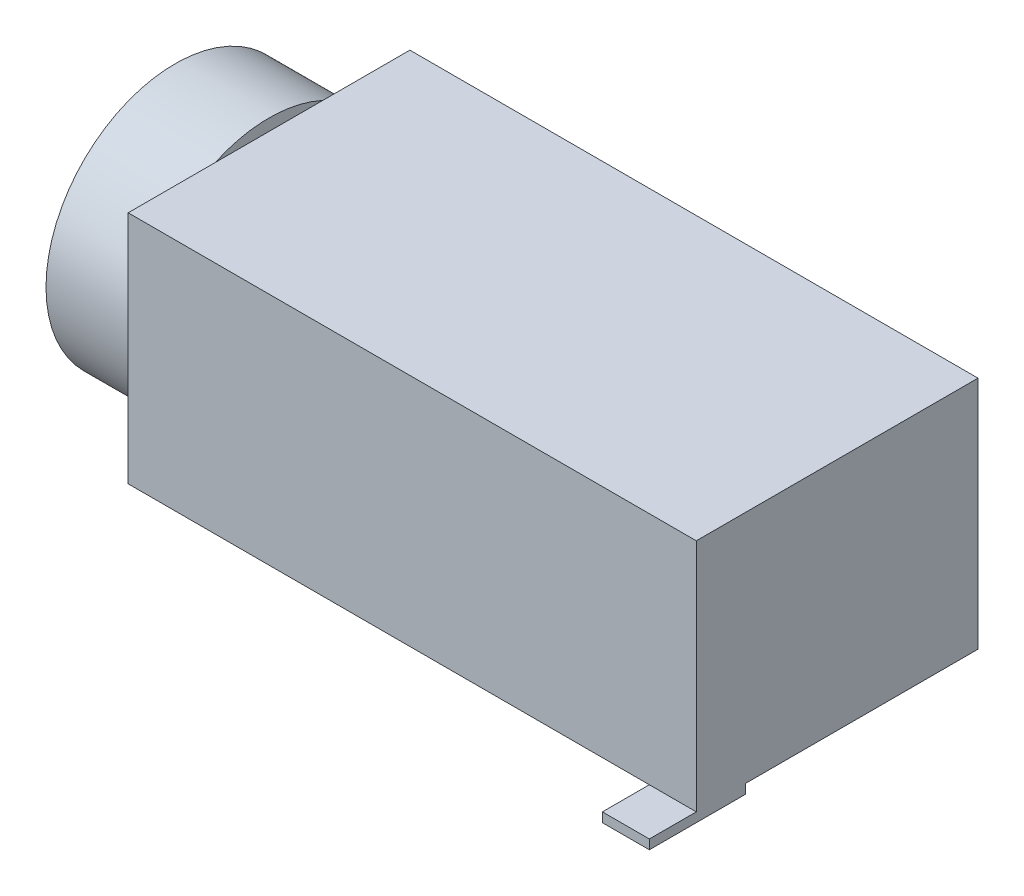
ISO-10303-21;
HEADER;
FILE_DESCRIPTION(('STEP AP214'),'2;1');
FILE_NAME('part.step','',(''),(''),'','','');
FILE_SCHEMA(('AUTOMOTIVE_DESIGN { 1 0 10303 214 1 1 1 1 }'));
ENDSEC;
DATA;
#1=APPLICATION_CONTEXT('core data for automotive mechanical design processes');
#2=APPLICATION_PROTOCOL_DEFINITION('international standard','automotive_design',2000,#1);
#3=PRODUCT_CONTEXT('',#1,'mechanical');
#4=PRODUCT('Part','Part','',(#3));
#5=PRODUCT_RELATED_PRODUCT_CATEGORY('part','',(#4));
#6=PRODUCT_DEFINITION_FORMATION('','',#4);
#7=PRODUCT_DEFINITION_CONTEXT('part definition',#1,'design');
#8=PRODUCT_DEFINITION('design','',#6,#7);
#9=PRODUCT_DEFINITION_SHAPE('','',#8);
#10=(LENGTH_UNIT() NAMED_UNIT(*) SI_UNIT(.MILLI.,.METRE.));
#11=(NAMED_UNIT(*) PLANE_ANGLE_UNIT() SI_UNIT($,.RADIAN.));
#12=(NAMED_UNIT(*) SI_UNIT($,.STERADIAN.) SOLID_ANGLE_UNIT());
#13=UNCERTAINTY_MEASURE_WITH_UNIT(LENGTH_MEASURE(1.E-05),#10,'distance_accuracy_value','');
#14=(GEOMETRIC_REPRESENTATION_CONTEXT(3) GLOBAL_UNCERTAINTY_ASSIGNED_CONTEXT((#13)) GLOBAL_UNIT_ASSIGNED_CONTEXT((#10,
#11,#12)) REPRESENTATION_CONTEXT('',''));
#15=CARTESIAN_POINT('',(0.,0.,0.));
#16=DIRECTION('',(0.,0.,1.));
#17=DIRECTION('',(1.,0.,0.));
#18=AXIS2_PLACEMENT_3D('',#15,#16,#17);
#19=CARTESIAN_POINT('',(0.,-2.5,0.));
#20=DIRECTION('',(0.,-1.,0.));
#21=DIRECTION('',(0.,0.,-1.));
#22=AXIS2_PLACEMENT_3D('',#19,#20,#21);
#23=PLANE('',#22);
#24=CARTESIAN_POINT('',(2.75,-2.5,0.));
#25=DIRECTION('',(0.,-1.,0.));
#26=DIRECTION('',(0.,0.,-1.));
#27=AXIS2_PLACEMENT_3D('',#24,#25,#26);
#28=CIRCLE('',#27,0.6);
#29=CARTESIAN_POINT('',(2.75,-2.5,-0.6));
#30=VERTEX_POINT('',#29);
#31=EDGE_CURVE('E330',#30,#30,#28,.T.);
#32=ORIENTED_EDGE('',*,*,#31,.F.);
#33=EDGE_LOOP('',(#32));
#34=FACE_BOUND('',#33,.T.);
#35=CARTESIAN_POINT('',(-4.25,-2.5,0.));
#36=DIRECTION('',(0.,-1.,0.));
#37=DIRECTION('',(0.,0.,-1.));
#38=AXIS2_PLACEMENT_3D('',#35,#36,#37);
#39=CIRCLE('',#38,0.6);
#40=CARTESIAN_POINT('',(-4.25,-2.5,-0.6));
#41=VERTEX_POINT('',#40);
#42=EDGE_CURVE('E333',#41,#41,#39,.T.);
#43=ORIENTED_EDGE('',*,*,#42,.F.);
#44=EDGE_LOOP('',(#43));
#45=FACE_BOUND('',#44,.T.);
#46=DIRECTION('',(-1.,0.,0.));
#47=VECTOR('',#46,1.);
#48=CARTESIAN_POINT('',(3.55,-2.5,-1.53969014221915));
#49=LINE('',#48,#47);
#50=CARTESIAN_POINT('',(4.55,-2.5,-1.53969014221915));
#51=VERTEX_POINT('',#50);
#52=CARTESIAN_POINT('',(3.55,-2.5,-1.53969014221915));
#53=VERTEX_POINT('',#52);
#54=EDGE_CURVE('E834',#51,#53,#49,.T.);
#55=ORIENTED_EDGE('',*,*,#54,.F.);
#56=DIRECTION('',(0.,0.,1.));
#57=VECTOR('',#56,1.);
#58=CARTESIAN_POINT('',(4.55,-2.5,-1.53969014221915));
#59=LINE('',#58,#57);
#60=CARTESIAN_POINT('',(4.55,-2.5,-3.));
#61=VERTEX_POINT('',#60);
#62=EDGE_CURVE('E843',#61,#51,#59,.T.);
#63=ORIENTED_EDGE('',*,*,#62,.F.);
#64=DIRECTION('',(-1.,0.,0.));
#65=VECTOR('',#64,1.);
#66=CARTESIAN_POINT('',(6.05,-2.5,-3.));
#67=LINE('',#66,#65);
#68=CARTESIAN_POINT('',(6.05,-2.5,-3.));
#69=VERTEX_POINT('',#68);
#70=EDGE_CURVE('E374',#69,#61,#67,.T.);
#71=ORIENTED_EDGE('',*,*,#70,.F.);
#72=DIRECTION('',(0.,0.,-1.));
#73=VECTOR('',#72,1.);
#74=CARTESIAN_POINT('',(6.05,-2.5,-3.));
#75=LINE('',#74,#73);
#76=CARTESIAN_POINT('',(6.05,-2.5,1.95249715108426));
#77=VERTEX_POINT('',#76);
#78=EDGE_CURVE('E371',#77,#69,#75,.T.);
#79=ORIENTED_EDGE('',*,*,#78,.F.);
#80=DIRECTION('',(1.,0.,0.));
#81=VECTOR('',#80,1.);
#82=CARTESIAN_POINT('',(5.05,-2.5,1.95249715108426));
#83=LINE('',#82,#81);
#84=CARTESIAN_POINT('',(5.05,-2.5,1.95249715108426));
#85=VERTEX_POINT('',#84);
#86=EDGE_CURVE('E316',#85,#77,#83,.T.);
#87=ORIENTED_EDGE('',*,*,#86,.F.);
#88=DIRECTION('',(0.,0.,1.));
#89=VECTOR('',#88,1.);
#90=CARTESIAN_POINT('',(5.05,-2.5,0.));
#91=LINE('',#90,#89);
#92=CARTESIAN_POINT('',(5.05,-2.5,3.));
#93=VERTEX_POINT('',#92);
#94=EDGE_CURVE('E11',#85,#93,#91,.T.);
#95=ORIENTED_EDGE('',*,*,#94,.T.);
#96=DIRECTION('',(1.,0.,0.));
#97=VECTOR('',#96,1.);
#98=CARTESIAN_POINT('',(6.05,-2.5,3.));
#99=LINE('',#98,#97);
#100=CARTESIAN_POINT('',(-6.05,-2.5,3.));
#101=VERTEX_POINT('',#100);
#102=EDGE_CURVE('E368',#101,#93,#99,.T.);
#103=ORIENTED_EDGE('',*,*,#102,.F.);
#104=DIRECTION('',(0.,0.,1.));
#105=VECTOR('',#104,1.);
#106=CARTESIAN_POINT('',(-6.05,-2.5,-3.));
#107=LINE('',#106,#105);
#108=CARTESIAN_POINT('',(-6.05,-2.5,1.14564392373896));
#109=VERTEX_POINT('',#108);
#110=EDGE_CURVE('E346',#109,#101,#107,.T.);
#111=ORIENTED_EDGE('',*,*,#110,.F.);
#112=CARTESIAN_POINT('',(-6.05,-2.5,-1.14564392373896));
#113=VERTEX_POINT('',#112);
#114=EDGE_CURVE('E367',#113,#109,#107,.T.);
#115=ORIENTED_EDGE('',*,*,#114,.F.);
#116=CARTESIAN_POINT('',(-6.05,-2.5,-3.));
#117=VERTEX_POINT('',#116);
#118=EDGE_CURVE('E363',#117,#113,#107,.T.);
#119=ORIENTED_EDGE('',*,*,#118,.F.);
#120=CARTESIAN_POINT('',(-3.45,-2.5,-3.));
#121=VERTEX_POINT('',#120);
#122=EDGE_CURVE('E373',#121,#117,#67,.T.);
#123=ORIENTED_EDGE('',*,*,#122,.F.);
#124=DIRECTION('',(0.,0.,-1.));
#125=VECTOR('',#124,1.);
#126=CARTESIAN_POINT('',(-3.45,-2.5,-1.53969014221915));
#127=LINE('',#126,#125);
#128=CARTESIAN_POINT('',(-3.45,-2.5,-1.53969014221915));
#129=VERTEX_POINT('',#128);
#130=EDGE_CURVE('E271',#129,#121,#127,.T.);
#131=ORIENTED_EDGE('',*,*,#130,.F.);
#132=DIRECTION('',(-1.,0.,0.));
#133=VECTOR('',#132,1.);
#134=CARTESIAN_POINT('',(-3.45,-2.5,-1.53969014221915));
#135=LINE('',#134,#133);
#136=CARTESIAN_POINT('',(-2.45,-2.5,-1.53969014221915));
#137=VERTEX_POINT('',#136);
#138=EDGE_CURVE('E284',#137,#129,#135,.T.);
#139=ORIENTED_EDGE('',*,*,#138,.F.);
#140=DIRECTION('',(0.,0.,1.));
#141=VECTOR('',#140,1.);
#142=CARTESIAN_POINT('',(-2.45,-2.5,-1.53969014221915));
#143=LINE('',#142,#141);
#144=CARTESIAN_POINT('',(-2.45,-2.5,-3.));
#145=VERTEX_POINT('',#144);
#146=EDGE_CURVE('E280',#145,#137,#143,.T.);
#147=ORIENTED_EDGE('',*,*,#146,.F.);
#148=CARTESIAN_POINT('',(-0.450000000000001,-2.5,-3.));
#149=VERTEX_POINT('',#148);
#150=EDGE_CURVE('E809',#149,#145,#67,.T.);
#151=ORIENTED_EDGE('',*,*,#150,.F.);
#152=DIRECTION('',(0.,0.,-1.));
#153=VECTOR('',#152,1.);
#154=CARTESIAN_POINT('',(-0.45,-2.5,-1.53969014221915));
#155=LINE('',#154,#153);
#156=CARTESIAN_POINT('',(-0.45,-2.5,-1.53969014221915));
#157=VERTEX_POINT('',#156);
#158=EDGE_CURVE('E56',#157,#149,#155,.T.);
#159=ORIENTED_EDGE('',*,*,#158,.F.);
#160=DIRECTION('',(-1.,0.,0.));
#161=VECTOR('',#160,1.);
#162=CARTESIAN_POINT('',(-0.45,-2.5,-1.53969014221915));
#163=LINE('',#162,#161);
#164=CARTESIAN_POINT('',(0.55,-2.5,-1.53969014221915));
#165=VERTEX_POINT('',#164);
#166=EDGE_CURVE('E252',#165,#157,#163,.T.);
#167=ORIENTED_EDGE('',*,*,#166,.F.);
#168=DIRECTION('',(0.,0.,1.));
#169=VECTOR('',#168,1.);
#170=CARTESIAN_POINT('',(0.55,-2.5,-1.53969014221915));
#171=LINE('',#170,#169);
#172=CARTESIAN_POINT('',(0.55,-2.5,-3.));
#173=VERTEX_POINT('',#172);
#174=EDGE_CURVE('E233',#173,#165,#171,.T.);
#175=ORIENTED_EDGE('',*,*,#174,.F.);
#176=CARTESIAN_POINT('',(3.55,-2.5,-3.));
#177=VERTEX_POINT('',#176);
#178=EDGE_CURVE('E378',#177,#173,#67,.T.);
#179=ORIENTED_EDGE('',*,*,#178,.F.);
#180=DIRECTION('',(0.,0.,-1.));
#181=VECTOR('',#180,1.);
#182=CARTESIAN_POINT('',(3.55,-2.5,-1.53969014221915));
#183=LINE('',#182,#181);
#184=EDGE_CURVE('E48',#53,#177,#183,.T.);
#185=ORIENTED_EDGE('',*,*,#184,.F.);
#186=EDGE_LOOP('',(#55,#63,#71,#79,#87,#95,#103,#111,#115,#119,#123,#131,#139,#147,#151,#159,
#167,#175,#179,#185));
#187=FACE_BOUND('',#186,.T.);
#188=ADVANCED_FACE('F33',(#34,#45,#187),#23,.T.);
#189=CARTESIAN_POINT('',(-6.05,2.5,-3.));
#190=DIRECTION('',(1.,0.,0.));
#191=DIRECTION('',(0.,0.,-1.));
#192=AXIS2_PLACEMENT_3D('',#189,#190,#191);
#193=PLANE('',#192);
#194=CARTESIAN_POINT('',(-6.05,0.,0.));
#195=DIRECTION('',(-1.,0.,0.));
#196=DIRECTION('',(0.,0.,1.));
#197=AXIS2_PLACEMENT_3D('',#194,#195,#196);
#198=CIRCLE('',#197,2.75);
#199=CARTESIAN_POINT('',(-6.05,2.5,-1.14564392373896));
#200=VERTEX_POINT('',#199);
#201=EDGE_CURVE('E395',#200,#113,#198,.T.);
#202=ORIENTED_EDGE('',*,*,#201,.F.);
#203=DIRECTION('',(0.,0.,1.));
#204=VECTOR('',#203,1.);
#205=CARTESIAN_POINT('',(-6.05,2.5,-3.));
#206=LINE('',#205,#204);
#207=CARTESIAN_POINT('',(-6.05,2.5,-3.));
#208=VERTEX_POINT('',#207);
#209=EDGE_CURVE('E351',#208,#200,#206,.T.);
#210=ORIENTED_EDGE('',*,*,#209,.F.);
#211=DIRECTION('',(0.,-1.,0.));
#212=VECTOR('',#211,1.);
#213=CARTESIAN_POINT('',(-6.05,2.5,-3.));
#214=LINE('',#213,#212);
#215=EDGE_CURVE('E362',#208,#117,#214,.T.);
#216=ORIENTED_EDGE('',*,*,#215,.T.);
#217=ORIENTED_EDGE('',*,*,#118,.T.);
#218=EDGE_LOOP('',(#202,#210,#216,#217));
#219=FACE_BOUND('',#218,.T.);
#220=ADVANCED_FACE('F426',(#219),#193,.F.);
#221=CARTESIAN_POINT('',(-6.05,2.5,1.14564392373896));
#222=VERTEX_POINT('',#221);
#223=EDGE_CURVE('E350',#109,#222,#198,.T.);
#224=ORIENTED_EDGE('',*,*,#223,.F.);
#225=ORIENTED_EDGE('',*,*,#110,.T.);
#226=DIRECTION('',(0.,-1.,0.));
#227=VECTOR('',#226,1.);
#228=CARTESIAN_POINT('',(-6.05,2.5,3.));
#229=LINE('',#228,#227);
#230=CARTESIAN_POINT('',(-6.05,2.5,3.));
#231=VERTEX_POINT('',#230);
#232=EDGE_CURVE('E388',#231,#101,#229,.T.);
#233=ORIENTED_EDGE('',*,*,#232,.F.);
#234=EDGE_CURVE('E356',#222,#231,#206,.T.);
#235=ORIENTED_EDGE('',*,*,#234,.F.);
#236=EDGE_LOOP('',(#224,#225,#233,#235));
#237=FACE_BOUND('',#236,.T.);
#238=ADVANCED_FACE('F432',(#237),#193,.F.);
#239=CARTESIAN_POINT('',(6.05,2.5,3.));
#240=DIRECTION('',(0.,0.,-1.));
#241=DIRECTION('',(-1.,0.,0.));
#242=AXIS2_PLACEMENT_3D('',#239,#240,#241);
#243=PLANE('',#242);
#244=ORIENTED_EDGE('',*,*,#102,.T.);
#245=CARTESIAN_POINT('',(6.05,-2.5,3.));
#246=VERTEX_POINT('',#245);
#247=EDGE_CURVE('E366',#93,#246,#99,.T.);
#248=ORIENTED_EDGE('',*,*,#247,.T.);
#249=DIRECTION('',(0.,-1.,0.));
#250=VECTOR('',#249,1.);
#251=CARTESIAN_POINT('',(6.05,2.5,3.));
#252=LINE('',#251,#250);
#253=CARTESIAN_POINT('',(6.05,2.5,3.));
#254=VERTEX_POINT('',#253);
#255=EDGE_CURVE('E385',#254,#246,#252,.T.);
#256=ORIENTED_EDGE('',*,*,#255,.F.);
#257=DIRECTION('',(1.,0.,0.));
#258=VECTOR('',#257,1.);
#259=CARTESIAN_POINT('',(6.05,2.5,3.));
#260=LINE('',#259,#258);
#261=EDGE_CURVE('E354',#231,#254,#260,.T.);
#262=ORIENTED_EDGE('',*,*,#261,.F.);
#263=ORIENTED_EDGE('',*,*,#232,.T.);
#264=EDGE_LOOP('',(#244,#248,#256,#262,#263));
#265=FACE_BOUND('',#264,.T.);
#266=ADVANCED_FACE('F448',(#265),#243,.F.);
#267=CARTESIAN_POINT('',(6.05,2.5,-3.));
#268=DIRECTION('',(-1.,0.,0.));
#269=DIRECTION('',(0.,0.,1.));
#270=AXIS2_PLACEMENT_3D('',#267,#268,#269);
#271=PLANE('',#270);
#272=ORIENTED_EDGE('',*,*,#255,.T.);
#273=DIRECTION('',(0.,0.,1.));
#274=VECTOR('',#273,1.);
#275=CARTESIAN_POINT('',(6.05,-2.5,4.));
#276=LINE('',#275,#274);
#277=CARTESIAN_POINT('',(6.05,-2.5,4.));
#278=VERTEX_POINT('',#277);
#279=EDGE_CURVE('E304',#246,#278,#276,.T.);
#280=ORIENTED_EDGE('',*,*,#279,.T.);
#281=DIRECTION('',(0.,1.,0.));
#282=VECTOR('',#281,1.);
#283=CARTESIAN_POINT('',(6.05,-2.7,4.));
#284=LINE('',#283,#282);
#285=CARTESIAN_POINT('',(6.05,-2.7,4.));
#286=VERTEX_POINT('',#285);
#287=EDGE_CURVE('E310',#286,#278,#284,.T.);
#288=ORIENTED_EDGE('',*,*,#287,.F.);
#289=DIRECTION('',(0.,0.,1.));
#290=VECTOR('',#289,1.);
#291=CARTESIAN_POINT('',(6.05,-2.7,4.));
#292=LINE('',#291,#290);
#293=CARTESIAN_POINT('',(6.05,-2.7,1.95249715108426));
#294=VERTEX_POINT('',#293);
#295=EDGE_CURVE('E308',#294,#286,#292,.T.);
#296=ORIENTED_EDGE('',*,*,#295,.F.);
#297=DIRECTION('',(0.,1.,0.));
#298=VECTOR('',#297,1.);
#299=CARTESIAN_POINT('',(6.05,-2.7,1.95249715108426));
#300=LINE('',#299,#298);
#301=EDGE_CURVE('E322',#294,#77,#300,.T.);
#302=ORIENTED_EDGE('',*,*,#301,.T.);
#303=ORIENTED_EDGE('',*,*,#78,.T.);
#304=DIRECTION('',(0.,-1.,0.));
#305=VECTOR('',#304,1.);
#306=CARTESIAN_POINT('',(6.05,2.5,-3.));
#307=LINE('',#306,#305);
#308=CARTESIAN_POINT('',(6.05,2.5,-3.));
#309=VERTEX_POINT('',#308);
#310=EDGE_CURVE('E382',#309,#69,#307,.T.);
#311=ORIENTED_EDGE('',*,*,#310,.F.);
#312=DIRECTION('',(0.,0.,-1.));
#313=VECTOR('',#312,1.);
#314=CARTESIAN_POINT('',(6.05,2.5,-3.));
#315=LINE('',#314,#313);
#316=EDGE_CURVE('E358',#254,#309,#315,.T.);
#317=ORIENTED_EDGE('',*,*,#316,.F.);
#318=EDGE_LOOP('',(#272,#280,#288,#296,#302,#303,#311,#317));
#319=FACE_BOUND('',#318,.T.);
#320=ADVANCED_FACE('F444',(#319),#271,.F.);
#321=CARTESIAN_POINT('',(6.05,2.5,-3.));
#322=DIRECTION('',(0.,0.,1.));
#323=DIRECTION('',(1.,0.,0.));
#324=AXIS2_PLACEMENT_3D('',#321,#322,#323);
#325=PLANE('',#324);
#326=ORIENTED_EDGE('',*,*,#70,.T.);
#327=EDGE_CURVE('E377',#61,#177,#67,.T.);
#328=ORIENTED_EDGE('',*,*,#327,.T.);
#329=ORIENTED_EDGE('',*,*,#178,.T.);
#330=EDGE_CURVE('E805',#173,#149,#67,.T.);
#331=ORIENTED_EDGE('',*,*,#330,.T.);
#332=ORIENTED_EDGE('',*,*,#150,.T.);
#333=EDGE_CURVE('E379',#145,#121,#67,.T.);
#334=ORIENTED_EDGE('',*,*,#333,.T.);
#335=ORIENTED_EDGE('',*,*,#122,.T.);
#336=ORIENTED_EDGE('',*,*,#215,.F.);
#337=DIRECTION('',(-1.,0.,0.));
#338=VECTOR('',#337,1.);
#339=CARTESIAN_POINT('',(6.05,2.5,-3.));
#340=LINE('',#339,#338);
#341=EDGE_CURVE('E360',#309,#208,#340,.T.);
#342=ORIENTED_EDGE('',*,*,#341,.F.);
#343=ORIENTED_EDGE('',*,*,#310,.T.);
#344=EDGE_LOOP('',(#326,#328,#329,#331,#332,#334,#335,#336,#342,#343));
#345=FACE_BOUND('',#344,.T.);
#346=ADVANCED_FACE('F441',(#345),#325,.F.);
#347=CARTESIAN_POINT('',(0.,2.5,0.));
#348=DIRECTION('',(0.,-1.,0.));
#349=DIRECTION('',(0.,0.,-1.));
#350=AXIS2_PLACEMENT_3D('',#347,#348,#349);
#351=PLANE('',#350);
#352=ORIENTED_EDGE('',*,*,#209,.T.);
#353=EDGE_CURVE('E355',#200,#222,#206,.T.);
#354=ORIENTED_EDGE('',*,*,#353,.T.);
#355=ORIENTED_EDGE('',*,*,#234,.T.);
#356=ORIENTED_EDGE('',*,*,#261,.T.);
#357=ORIENTED_EDGE('',*,*,#316,.T.);
#358=ORIENTED_EDGE('',*,*,#341,.T.);
#359=EDGE_LOOP('',(#352,#354,#355,#356,#357,#358));
#360=FACE_BOUND('',#359,.T.);
#361=ADVANCED_FACE('F439',(#360),#351,.F.);
#362=CARTESIAN_POINT('',(-6.05,0.,0.));
#363=DIRECTION('',(-1.,0.,0.));
#364=DIRECTION('',(0.,0.,1.));
#365=AXIS2_PLACEMENT_3D('',#362,#363,#364);
#366=PLANE('',#365);
#367=EDGE_CURVE('E340',#113,#109,#198,.T.);
#368=ORIENTED_EDGE('',*,*,#367,.F.);
#369=ORIENTED_EDGE('',*,*,#114,.T.);
#370=EDGE_LOOP('',(#368,#369));
#371=FACE_BOUND('',#370,.T.);
#372=ADVANCED_FACE('F679',(#371),#366,.F.);
#373=CARTESIAN_POINT('',(-8.05,0.,0.));
#374=DIRECTION('',(-1.,0.,0.));
#375=DIRECTION('',(0.,0.,1.));
#376=AXIS2_PLACEMENT_3D('',#373,#374,#375);
#377=PLANE('',#376);
#378=CARTESIAN_POINT('',(-8.05,0.,0.));
#379=DIRECTION('',(-1.,0.,0.));
#380=DIRECTION('',(0.,0.,1.));
#381=AXIS2_PLACEMENT_3D('',#378,#379,#380);
#382=CIRCLE('',#381,2.75);
#383=CARTESIAN_POINT('',(-8.05,0.,2.75));
#384=VERTEX_POINT('',#383);
#385=EDGE_CURVE('E343',#384,#384,#382,.T.);
#386=ORIENTED_EDGE('',*,*,#385,.T.);
#387=EDGE_LOOP('',(#386));
#388=FACE_BOUND('',#387,.T.);
#389=CARTESIAN_POINT('',(-8.05,0.,0.));
#390=DIRECTION('',(-1.,0.,0.));
#391=DIRECTION('',(0.,0.,1.));
#392=AXIS2_PLACEMENT_3D('',#389,#390,#391);
#393=CIRCLE('',#392,1.8);
#394=CARTESIAN_POINT('',(-8.05,0.,1.8));
#395=VERTEX_POINT('',#394);
#396=EDGE_CURVE('E337',#395,#395,#393,.T.);
#397=ORIENTED_EDGE('',*,*,#396,.F.);
#398=EDGE_LOOP('',(#397));
#399=FACE_BOUND('',#398,.T.);
#400=ADVANCED_FACE('F686',(#388,#399),#377,.T.);
#401=ORIENTED_EDGE('',*,*,#353,.F.);
#402=EDGE_CURVE('E347',#222,#200,#198,.T.);
#403=ORIENTED_EDGE('',*,*,#402,.F.);
#404=EDGE_LOOP('',(#401,#403));
#405=FACE_BOUND('',#404,.T.);
#406=ADVANCED_FACE('F689',(#405),#366,.F.);
#407=CARTESIAN_POINT('',(-8.05,0.,0.));
#408=DIRECTION('',(1.,0.,0.));
#409=DIRECTION('',(0.,0.,-1.));
#410=AXIS2_PLACEMENT_3D('',#407,#408,#409);
#411=CYLINDRICAL_SURFACE('',#410,2.75);
#412=ORIENTED_EDGE('',*,*,#385,.F.);
#413=EDGE_LOOP('',(#412));
#414=FACE_BOUND('',#413,.T.);
#415=ORIENTED_EDGE('',*,*,#402,.T.);
#416=ORIENTED_EDGE('',*,*,#201,.T.);
#417=ORIENTED_EDGE('',*,*,#367,.T.);
#418=ORIENTED_EDGE('',*,*,#223,.T.);
#419=EDGE_LOOP('',(#415,#416,#417,#418));
#420=FACE_BOUND('',#419,.T.);
#421=ADVANCED_FACE('F702',(#414,#420),#411,.T.);
#422=CARTESIAN_POINT('',(-8.05,0.,0.));
#423=DIRECTION('',(1.,0.,0.));
#424=DIRECTION('',(0.,0.,-1.));
#425=AXIS2_PLACEMENT_3D('',#422,#423,#424);
#426=CYLINDRICAL_SURFACE('',#425,1.8);
#427=ORIENTED_EDGE('',*,*,#396,.T.);
#428=EDGE_LOOP('',(#427));
#429=FACE_BOUND('',#428,.T.);
#430=CARTESIAN_POINT('',(-6.05,0.,0.));
#431=DIRECTION('',(-1.,0.,0.));
#432=DIRECTION('',(0.,0.,1.));
#433=AXIS2_PLACEMENT_3D('',#430,#431,#432);
#434=CIRCLE('',#433,1.8);
#435=CARTESIAN_POINT('',(-6.05,0.,1.8));
#436=VERTEX_POINT('',#435);
#437=EDGE_CURVE('E336',#436,#436,#434,.T.);
#438=ORIENTED_EDGE('',*,*,#437,.F.);
#439=EDGE_LOOP('',(#438));
#440=FACE_BOUND('',#439,.T.);
#441=ADVANCED_FACE('F709',(#429,#440),#426,.F.);
#442=ORIENTED_EDGE('',*,*,#437,.T.);
#443=EDGE_LOOP('',(#442));
#444=FACE_BOUND('',#443,.T.);
#445=ADVANCED_FACE('F423',(#444),#193,.F.);
#446=CARTESIAN_POINT('',(-4.25,-3.3,0.));
#447=DIRECTION('',(0.,1.,0.));
#448=DIRECTION('',(0.,0.,1.));
#449=AXIS2_PLACEMENT_3D('',#446,#447,#448);
#450=CYLINDRICAL_SURFACE('',#449,0.6);
#451=CARTESIAN_POINT('',(-4.25,-3.1,0.));
#452=DIRECTION('',(0.,-1.,0.));
#453=DIRECTION('',(0.,0.,-1.));
#454=AXIS2_PLACEMENT_3D('',#451,#452,#453);
#455=CIRCLE('',#454,0.6);
#456=CARTESIAN_POINT('',(-4.25,-3.1,-0.6));
#457=VERTEX_POINT('',#456);
#458=EDGE_CURVE('E41',#457,#457,#455,.F.);
#459=ORIENTED_EDGE('',*,*,#458,.T.);
#460=EDGE_LOOP('',(#459));
#461=FACE_BOUND('',#460,.T.);
#462=ORIENTED_EDGE('',*,*,#42,.T.);
#463=EDGE_LOOP('',(#462));
#464=FACE_BOUND('',#463,.T.);
#465=ADVANCED_FACE('F403',(#461,#464),#450,.T.);
#466=CARTESIAN_POINT('',(-4.25,-3.3,0.));
#467=DIRECTION('',(0.,-1.,0.));
#468=DIRECTION('',(0.,0.,-1.));
#469=AXIS2_PLACEMENT_3D('',#466,#467,#468);
#470=PLANE('',#469);
#471=CARTESIAN_POINT('',(-4.25,-3.3,0.));
#472=DIRECTION('',(0.,-1.,0.));
#473=DIRECTION('',(0.,0.,-1.));
#474=AXIS2_PLACEMENT_3D('',#471,#472,#473);
#475=CIRCLE('',#474,0.4);
#476=CARTESIAN_POINT('',(-4.25,-3.3,-0.4));
#477=VERTEX_POINT('',#476);
#478=EDGE_CURVE('E398',#477,#477,#475,.T.);
#479=ORIENTED_EDGE('',*,*,#478,.T.);
#480=EDGE_LOOP('',(#479));
#481=FACE_BOUND('',#480,.T.);
#482=ADVANCED_FACE('F412',(#481),#470,.T.);
#483=CARTESIAN_POINT('',(2.75,-3.3,0.));
#484=DIRECTION('',(0.,1.,0.));
#485=DIRECTION('',(0.,0.,1.));
#486=AXIS2_PLACEMENT_3D('',#483,#484,#485);
#487=CYLINDRICAL_SURFACE('',#486,0.6);
#488=CARTESIAN_POINT('',(2.75,-3.1,0.));
#489=DIRECTION('',(0.,-1.,0.));
#490=DIRECTION('',(0.,0.,-1.));
#491=AXIS2_PLACEMENT_3D('',#488,#489,#490);
#492=CIRCLE('',#491,0.6);
#493=CARTESIAN_POINT('',(2.75,-3.1,-0.6));
#494=VERTEX_POINT('',#493);
#495=EDGE_CURVE('E394',#494,#494,#492,.F.);
#496=ORIENTED_EDGE('',*,*,#495,.T.);
#497=EDGE_LOOP('',(#496));
#498=FACE_BOUND('',#497,.T.);
#499=ORIENTED_EDGE('',*,*,#31,.T.);
#500=EDGE_LOOP('',(#499));
#501=FACE_BOUND('',#500,.T.);
#502=ADVANCED_FACE('F414',(#498,#501),#487,.T.);
#503=CARTESIAN_POINT('',(2.75,-3.3,0.));
#504=DIRECTION('',(0.,-1.,0.));
#505=DIRECTION('',(0.,0.,-1.));
#506=AXIS2_PLACEMENT_3D('',#503,#504,#505);
#507=PLANE('',#506);
#508=CARTESIAN_POINT('',(2.75,-3.3,0.));
#509=DIRECTION('',(0.,-1.,0.));
#510=DIRECTION('',(0.,0.,-1.));
#511=AXIS2_PLACEMENT_3D('',#508,#509,#510);
#512=CIRCLE('',#511,0.4);
#513=CARTESIAN_POINT('',(2.75,-3.3,-0.4));
#514=VERTEX_POINT('',#513);
#515=EDGE_CURVE('E391',#514,#514,#512,.T.);
#516=ORIENTED_EDGE('',*,*,#515,.T.);
#517=EDGE_LOOP('',(#516));
#518=FACE_BOUND('',#517,.T.);
#519=ADVANCED_FACE('F420',(#518),#507,.T.);
#520=CARTESIAN_POINT('',(2.75,-3.1,0.));
#521=DIRECTION('',(0.,-1.,0.));
#522=DIRECTION('',(0.,0.,-1.));
#523=AXIS2_PLACEMENT_3D('',#520,#521,#522);
#524=TOROIDAL_SURFACE('',#523,0.4,0.2);
#525=ORIENTED_EDGE('',*,*,#495,.F.);
#526=EDGE_LOOP('',(#525));
#527=FACE_BOUND('',#526,.T.);
#528=ORIENTED_EDGE('',*,*,#515,.F.);
#529=EDGE_LOOP('',(#528));
#530=FACE_BOUND('',#529,.T.);
#531=ADVANCED_FACE('F409',(#527,#530),#524,.T.);
#532=CARTESIAN_POINT('',(-4.25,-3.1,0.));
#533=DIRECTION('',(0.,-1.,0.));
#534=DIRECTION('',(0.,0.,-1.));
#535=AXIS2_PLACEMENT_3D('',#532,#533,#534);
#536=TOROIDAL_SURFACE('',#535,0.4,0.2);
#537=ORIENTED_EDGE('',*,*,#458,.F.);
#538=EDGE_LOOP('',(#537));
#539=FACE_BOUND('',#538,.T.);
#540=ORIENTED_EDGE('',*,*,#478,.F.);
#541=EDGE_LOOP('',(#540));
#542=FACE_BOUND('',#541,.T.);
#543=ADVANCED_FACE('F35',(#539,#542),#536,.T.);
#544=CARTESIAN_POINT('',(0.,-2.5,0.));
#545=DIRECTION('',(0.,1.,0.));
#546=DIRECTION('',(0.,0.,1.));
#547=AXIS2_PLACEMENT_3D('',#544,#545,#546);
#548=PLANE('',#547);
#549=ORIENTED_EDGE('',*,*,#247,.F.);
#550=DIRECTION('',(0.,0.,-1.));
#551=VECTOR('',#550,1.);
#552=CARTESIAN_POINT('',(5.05,-2.5,4.));
#553=LINE('',#552,#551);
#554=CARTESIAN_POINT('',(5.05,-2.5,4.));
#555=VERTEX_POINT('',#554);
#556=EDGE_CURVE('E313',#555,#93,#553,.T.);
#557=ORIENTED_EDGE('',*,*,#556,.F.);
#558=DIRECTION('',(-1.,0.,0.));
#559=VECTOR('',#558,1.);
#560=CARTESIAN_POINT('',(5.05,-2.5,4.));
#561=LINE('',#560,#559);
#562=EDGE_CURVE('E299',#278,#555,#561,.T.);
#563=ORIENTED_EDGE('',*,*,#562,.F.);
#564=ORIENTED_EDGE('',*,*,#279,.F.);
#565=EDGE_LOOP('',(#549,#557,#563,#564));
#566=FACE_BOUND('',#565,.T.);
#567=ADVANCED_FACE('F408',(#566),#548,.T.);
#568=CARTESIAN_POINT('',(5.05,-2.7,4.));
#569=DIRECTION('',(0.,0.,-1.));
#570=DIRECTION('',(-1.,0.,0.));
#571=AXIS2_PLACEMENT_3D('',#568,#569,#570);
#572=PLANE('',#571);
#573=ORIENTED_EDGE('',*,*,#562,.T.);
#574=DIRECTION('',(0.,1.,0.));
#575=VECTOR('',#574,1.);
#576=CARTESIAN_POINT('',(5.05,-2.7,4.));
#577=LINE('',#576,#575);
#578=CARTESIAN_POINT('',(5.05,-2.7,4.));
#579=VERTEX_POINT('',#578);
#580=EDGE_CURVE('E327',#579,#555,#577,.T.);
#581=ORIENTED_EDGE('',*,*,#580,.F.);
#582=DIRECTION('',(-1.,0.,0.));
#583=VECTOR('',#582,1.);
#584=CARTESIAN_POINT('',(5.05,-2.7,4.));
#585=LINE('',#584,#583);
#586=EDGE_CURVE('E300',#286,#579,#585,.T.);
#587=ORIENTED_EDGE('',*,*,#586,.F.);
#588=ORIENTED_EDGE('',*,*,#287,.T.);
#589=EDGE_LOOP('',(#573,#581,#587,#588));
#590=FACE_BOUND('',#589,.T.);
#591=ADVANCED_FACE('F468',(#590),#572,.F.);
#592=CARTESIAN_POINT('',(5.05,-2.7,4.));
#593=DIRECTION('',(1.,0.,0.));
#594=DIRECTION('',(0.,0.,-1.));
#595=AXIS2_PLACEMENT_3D('',#592,#593,#594);
#596=PLANE('',#595);
#597=ORIENTED_EDGE('',*,*,#556,.T.);
#598=ORIENTED_EDGE('',*,*,#94,.F.);
#599=DIRECTION('',(0.,1.,0.));
#600=VECTOR('',#599,1.);
#601=CARTESIAN_POINT('',(5.05,-2.7,1.95249715108426));
#602=LINE('',#601,#600);
#603=CARTESIAN_POINT('',(5.05,-2.7,1.95249715108426));
#604=VERTEX_POINT('',#603);
#605=EDGE_CURVE('E324',#604,#85,#602,.T.);
#606=ORIENTED_EDGE('',*,*,#605,.F.);
#607=DIRECTION('',(0.,0.,-1.));
#608=VECTOR('',#607,1.);
#609=CARTESIAN_POINT('',(5.05,-2.7,4.));
#610=LINE('',#609,#608);
#611=EDGE_CURVE('E303',#579,#604,#610,.T.);
#612=ORIENTED_EDGE('',*,*,#611,.F.);
#613=ORIENTED_EDGE('',*,*,#580,.T.);
#614=EDGE_LOOP('',(#597,#598,#606,#612,#613));
#615=FACE_BOUND('',#614,.T.);
#616=ADVANCED_FACE('F471',(#615),#596,.F.);
#617=CARTESIAN_POINT('',(5.05,-2.7,1.95249715108426));
#618=DIRECTION('',(0.,0.,1.));
#619=DIRECTION('',(1.,0.,0.));
#620=AXIS2_PLACEMENT_3D('',#617,#618,#619);
#621=PLANE('',#620);
#622=ORIENTED_EDGE('',*,*,#86,.T.);
#623=ORIENTED_EDGE('',*,*,#301,.F.);
#624=DIRECTION('',(1.,0.,0.));
#625=VECTOR('',#624,1.);
#626=CARTESIAN_POINT('',(5.05,-2.7,1.95249715108426));
#627=LINE('',#626,#625);
#628=EDGE_CURVE('E306',#604,#294,#627,.T.);
#629=ORIENTED_EDGE('',*,*,#628,.F.);
#630=ORIENTED_EDGE('',*,*,#605,.T.);
#631=EDGE_LOOP('',(#622,#623,#629,#630));
#632=FACE_BOUND('',#631,.T.);
#633=ADVANCED_FACE('F475',(#632),#621,.F.);
#634=CARTESIAN_POINT('',(0.,-2.7,0.));
#635=DIRECTION('',(0.,1.,0.));
#636=DIRECTION('',(0.,0.,1.));
#637=AXIS2_PLACEMENT_3D('',#634,#635,#636);
#638=PLANE('',#637);
#639=ORIENTED_EDGE('',*,*,#586,.T.);
#640=ORIENTED_EDGE('',*,*,#611,.T.);
#641=ORIENTED_EDGE('',*,*,#628,.T.);
#642=ORIENTED_EDGE('',*,*,#295,.T.);
#643=EDGE_LOOP('',(#639,#640,#641,#642));
#644=FACE_BOUND('',#643,.T.);
#645=ADVANCED_FACE('F479',(#644),#638,.F.);
#646=CARTESIAN_POINT('',(0.,-2.5,0.));
#647=DIRECTION('',(0.,1.,0.));
#648=DIRECTION('',(0.,0.,1.));
#649=AXIS2_PLACEMENT_3D('',#646,#647,#648);
#650=PLANE('',#649);
#651=ORIENTED_EDGE('',*,*,#333,.F.);
#652=CARTESIAN_POINT('',(-2.45,-2.5,-4.));
#653=VERTEX_POINT('',#652);
#654=EDGE_CURVE('E281',#653,#145,#143,.T.);
#655=ORIENTED_EDGE('',*,*,#654,.F.);
#656=DIRECTION('',(1.,0.,0.));
#657=VECTOR('',#656,1.);
#658=CARTESIAN_POINT('',(-3.45,-2.5,-4.));
#659=LINE('',#658,#657);
#660=CARTESIAN_POINT('',(-3.45,-2.5,-4.));
#661=VERTEX_POINT('',#660);
#662=EDGE_CURVE('E266',#661,#653,#659,.T.);
#663=ORIENTED_EDGE('',*,*,#662,.F.);
#664=EDGE_CURVE('E286',#121,#661,#127,.T.);
#665=ORIENTED_EDGE('',*,*,#664,.F.);
#666=EDGE_LOOP('',(#651,#655,#663,#665));
#667=FACE_BOUND('',#666,.T.);
#668=ADVANCED_FACE('F486',(#667),#650,.T.);
#669=CARTESIAN_POINT('',(-3.45,-2.7,-4.));
#670=DIRECTION('',(0.,0.,1.));
#671=DIRECTION('',(1.,0.,0.));
#672=AXIS2_PLACEMENT_3D('',#669,#670,#671);
#673=PLANE('',#672);
#674=ORIENTED_EDGE('',*,*,#662,.T.);
#675=DIRECTION('',(0.,1.,0.));
#676=VECTOR('',#675,1.);
#677=CARTESIAN_POINT('',(-2.45,-2.7,-4.));
#678=LINE('',#677,#676);
#679=CARTESIAN_POINT('',(-2.45,-2.7,-4.));
#680=VERTEX_POINT('',#679);
#681=EDGE_CURVE('E296',#680,#653,#678,.T.);
#682=ORIENTED_EDGE('',*,*,#681,.F.);
#683=DIRECTION('',(1.,0.,0.));
#684=VECTOR('',#683,1.);
#685=CARTESIAN_POINT('',(-3.45,-2.7,-4.));
#686=LINE('',#685,#684);
#687=CARTESIAN_POINT('',(-3.45,-2.7,-4.));
#688=VERTEX_POINT('',#687);
#689=EDGE_CURVE('E267',#688,#680,#686,.T.);
#690=ORIENTED_EDGE('',*,*,#689,.F.);
#691=DIRECTION('',(0.,1.,0.));
#692=VECTOR('',#691,1.);
#693=CARTESIAN_POINT('',(-3.45,-2.7,-4.));
#694=LINE('',#693,#692);
#695=EDGE_CURVE('E277',#688,#661,#694,.T.);
#696=ORIENTED_EDGE('',*,*,#695,.T.);
#697=EDGE_LOOP('',(#674,#682,#690,#696));
#698=FACE_BOUND('',#697,.T.);
#699=ADVANCED_FACE('F488',(#698),#673,.F.);
#700=CARTESIAN_POINT('',(-2.45,-2.7,-1.53969014221915));
#701=DIRECTION('',(-1.,0.,0.));
#702=DIRECTION('',(0.,0.,1.));
#703=AXIS2_PLACEMENT_3D('',#700,#701,#702);
#704=PLANE('',#703);
#705=ORIENTED_EDGE('',*,*,#654,.T.);
#706=ORIENTED_EDGE('',*,*,#146,.T.);
#707=DIRECTION('',(0.,1.,0.));
#708=VECTOR('',#707,1.);
#709=CARTESIAN_POINT('',(-2.45,-2.7,-1.53969014221915));
#710=LINE('',#709,#708);
#711=CARTESIAN_POINT('',(-2.45,-2.7,-1.53969014221915));
#712=VERTEX_POINT('',#711);
#713=EDGE_CURVE('E293',#712,#137,#710,.T.);
#714=ORIENTED_EDGE('',*,*,#713,.F.);
#715=DIRECTION('',(0.,0.,1.));
#716=VECTOR('',#715,1.);
#717=CARTESIAN_POINT('',(-2.45,-2.7,-1.53969014221915));
#718=LINE('',#717,#716);
#719=EDGE_CURVE('E270',#680,#712,#718,.T.);
#720=ORIENTED_EDGE('',*,*,#719,.F.);
#721=ORIENTED_EDGE('',*,*,#681,.T.);
#722=EDGE_LOOP('',(#705,#706,#714,#720,#721));
#723=FACE_BOUND('',#722,.T.);
#724=ADVANCED_FACE('F491',(#723),#704,.F.);
#725=CARTESIAN_POINT('',(-3.45,-2.7,-1.53969014221915));
#726=DIRECTION('',(0.,0.,-1.));
#727=DIRECTION('',(-1.,0.,0.));
#728=AXIS2_PLACEMENT_3D('',#725,#726,#727);
#729=PLANE('',#728);
#730=ORIENTED_EDGE('',*,*,#138,.T.);
#731=DIRECTION('',(0.,1.,0.));
#732=VECTOR('',#731,1.);
#733=CARTESIAN_POINT('',(-3.45,-2.7,-1.53969014221915));
#734=LINE('',#733,#732);
#735=CARTESIAN_POINT('',(-3.45,-2.7,-1.53969014221915));
#736=VERTEX_POINT('',#735);
#737=EDGE_CURVE('E290',#736,#129,#734,.T.);
#738=ORIENTED_EDGE('',*,*,#737,.F.);
#739=DIRECTION('',(-1.,0.,0.));
#740=VECTOR('',#739,1.);
#741=CARTESIAN_POINT('',(-3.45,-2.7,-1.53969014221915));
#742=LINE('',#741,#740);
#743=EDGE_CURVE('E273',#712,#736,#742,.T.);
#744=ORIENTED_EDGE('',*,*,#743,.F.);
#745=ORIENTED_EDGE('',*,*,#713,.T.);
#746=EDGE_LOOP('',(#730,#738,#744,#745));
#747=FACE_BOUND('',#746,.T.);
#748=ADVANCED_FACE('F495',(#747),#729,.F.);
#749=CARTESIAN_POINT('',(-3.45,-2.7,-1.53969014221915));
#750=DIRECTION('',(1.,0.,0.));
#751=DIRECTION('',(0.,0.,-1.));
#752=AXIS2_PLACEMENT_3D('',#749,#750,#751);
#753=PLANE('',#752);
#754=ORIENTED_EDGE('',*,*,#130,.T.);
#755=ORIENTED_EDGE('',*,*,#664,.T.);
#756=ORIENTED_EDGE('',*,*,#695,.F.);
#757=DIRECTION('',(0.,0.,-1.));
#758=VECTOR('',#757,1.);
#759=CARTESIAN_POINT('',(-3.45,-2.7,-1.53969014221915));
#760=LINE('',#759,#758);
#761=EDGE_CURVE('E275',#736,#688,#760,.T.);
#762=ORIENTED_EDGE('',*,*,#761,.F.);
#763=ORIENTED_EDGE('',*,*,#737,.T.);
#764=EDGE_LOOP('',(#754,#755,#756,#762,#763));
#765=FACE_BOUND('',#764,.T.);
#766=ADVANCED_FACE('F499',(#765),#753,.F.);
#767=CARTESIAN_POINT('',(0.,-2.7,0.));
#768=DIRECTION('',(0.,1.,0.));
#769=DIRECTION('',(0.,0.,1.));
#770=AXIS2_PLACEMENT_3D('',#767,#768,#769);
#771=PLANE('',#770);
#772=ORIENTED_EDGE('',*,*,#689,.T.);
#773=ORIENTED_EDGE('',*,*,#719,.T.);
#774=ORIENTED_EDGE('',*,*,#743,.T.);
#775=ORIENTED_EDGE('',*,*,#761,.T.);
#776=EDGE_LOOP('',(#772,#773,#774,#775));
#777=FACE_BOUND('',#776,.T.);
#778=ADVANCED_FACE('F503',(#777),#771,.F.);
#779=CARTESIAN_POINT('',(0.,-2.5,0.));
#780=DIRECTION('',(0.,1.,0.));
#781=DIRECTION('',(0.,0.,1.));
#782=AXIS2_PLACEMENT_3D('',#779,#780,#781);
#783=PLANE('',#782);
#784=ORIENTED_EDGE('',*,*,#330,.F.);
#785=CARTESIAN_POINT('',(0.55,-2.5,-4.));
#786=VERTEX_POINT('',#785);
#787=EDGE_CURVE('E249',#786,#173,#171,.T.);
#788=ORIENTED_EDGE('',*,*,#787,.F.);
#789=DIRECTION('',(1.,0.,0.));
#790=VECTOR('',#789,1.);
#791=CARTESIAN_POINT('',(-0.45,-2.5,-4.));
#792=LINE('',#791,#790);
#793=CARTESIAN_POINT('',(-0.45,-2.5,-4.));
#794=VERTEX_POINT('',#793);
#795=EDGE_CURVE('E230',#794,#786,#792,.T.);
#796=ORIENTED_EDGE('',*,*,#795,.F.);
#797=EDGE_CURVE('E254',#149,#794,#155,.T.);
#798=ORIENTED_EDGE('',*,*,#797,.F.);
#799=EDGE_LOOP('',(#784,#788,#796,#798));
#800=FACE_BOUND('',#799,.T.);
#801=ADVANCED_FACE('F510',(#800),#783,.T.);
#802=CARTESIAN_POINT('',(-0.45,-2.7,-4.));
#803=DIRECTION('',(0.,0.,1.));
#804=DIRECTION('',(1.,0.,0.));
#805=AXIS2_PLACEMENT_3D('',#802,#803,#804);
#806=PLANE('',#805);
#807=ORIENTED_EDGE('',*,*,#795,.T.);
#808=DIRECTION('',(0.,1.,0.));
#809=VECTOR('',#808,1.);
#810=CARTESIAN_POINT('',(0.55,-2.7,-4.));
#811=LINE('',#810,#809);
#812=CARTESIAN_POINT('',(0.55,-2.7,-4.));
#813=VERTEX_POINT('',#812);
#814=EDGE_CURVE('E263',#813,#786,#811,.T.);
#815=ORIENTED_EDGE('',*,*,#814,.F.);
#816=DIRECTION('',(1.,0.,0.));
#817=VECTOR('',#816,1.);
#818=CARTESIAN_POINT('',(-0.45,-2.7,-4.));
#819=LINE('',#818,#817);
#820=CARTESIAN_POINT('',(-0.45,-2.7,-4.));
#821=VERTEX_POINT('',#820);
#822=EDGE_CURVE('E239',#821,#813,#819,.T.);
#823=ORIENTED_EDGE('',*,*,#822,.F.);
#824=DIRECTION('',(0.,1.,0.));
#825=VECTOR('',#824,1.);
#826=CARTESIAN_POINT('',(-0.45,-2.7,-4.));
#827=LINE('',#826,#825);
#828=EDGE_CURVE('E247',#821,#794,#827,.T.);
#829=ORIENTED_EDGE('',*,*,#828,.T.);
#830=EDGE_LOOP('',(#807,#815,#823,#829));
#831=FACE_BOUND('',#830,.T.);
#832=ADVANCED_FACE('F512',(#831),#806,.F.);
#833=CARTESIAN_POINT('',(0.55,-2.7,-1.53969014221915));
#834=DIRECTION('',(-1.,0.,0.));
#835=DIRECTION('',(0.,0.,1.));
#836=AXIS2_PLACEMENT_3D('',#833,#834,#835);
#837=PLANE('',#836);
#838=ORIENTED_EDGE('',*,*,#787,.T.);
#839=ORIENTED_EDGE('',*,*,#174,.T.);
#840=DIRECTION('',(0.,1.,0.));
#841=VECTOR('',#840,1.);
#842=CARTESIAN_POINT('',(0.55,-2.7,-1.53969014221915));
#843=LINE('',#842,#841);
#844=CARTESIAN_POINT('',(0.55,-2.7,-1.53969014221915));
#845=VERTEX_POINT('',#844);
#846=EDGE_CURVE('E260',#845,#165,#843,.T.);
#847=ORIENTED_EDGE('',*,*,#846,.F.);
#848=DIRECTION('',(0.,0.,1.));
#849=VECTOR('',#848,1.);
#850=CARTESIAN_POINT('',(0.55,-2.7,-1.53969014221915));
#851=LINE('',#850,#849);
#852=EDGE_CURVE('E242',#813,#845,#851,.T.);
#853=ORIENTED_EDGE('',*,*,#852,.F.);
#854=ORIENTED_EDGE('',*,*,#814,.T.);
#855=EDGE_LOOP('',(#838,#839,#847,#853,#854));
#856=FACE_BOUND('',#855,.T.);
#857=ADVANCED_FACE('F515',(#856),#837,.F.);
#858=CARTESIAN_POINT('',(-0.45,-2.7,-1.53969014221915));
#859=DIRECTION('',(0.,0.,-1.));
#860=DIRECTION('',(-1.,0.,0.));
#861=AXIS2_PLACEMENT_3D('',#858,#859,#860);
#862=PLANE('',#861);
#863=ORIENTED_EDGE('',*,*,#166,.T.);
#864=DIRECTION('',(0.,1.,0.));
#865=VECTOR('',#864,1.);
#866=CARTESIAN_POINT('',(-0.45,-2.7,-1.53969014221915));
#867=LINE('',#866,#865);
#868=CARTESIAN_POINT('',(-0.45,-2.7,-1.53969014221915));
#869=VERTEX_POINT('',#868);
#870=EDGE_CURVE('E258',#869,#157,#867,.T.);
#871=ORIENTED_EDGE('',*,*,#870,.F.);
#872=DIRECTION('',(-1.,0.,0.));
#873=VECTOR('',#872,1.);
#874=CARTESIAN_POINT('',(-0.45,-2.7,-1.53969014221915));
#875=LINE('',#874,#873);
#876=EDGE_CURVE('E244',#845,#869,#875,.T.);
#877=ORIENTED_EDGE('',*,*,#876,.F.);
#878=ORIENTED_EDGE('',*,*,#846,.T.);
#879=EDGE_LOOP('',(#863,#871,#877,#878));
#880=FACE_BOUND('',#879,.T.);
#881=ADVANCED_FACE('F519',(#880),#862,.F.);
#882=CARTESIAN_POINT('',(-0.45,-2.7,-1.53969014221915));
#883=DIRECTION('',(1.,0.,0.));
#884=DIRECTION('',(0.,0.,-1.));
#885=AXIS2_PLACEMENT_3D('',#882,#883,#884);
#886=PLANE('',#885);
#887=ORIENTED_EDGE('',*,*,#158,.T.);
#888=ORIENTED_EDGE('',*,*,#797,.T.);
#889=ORIENTED_EDGE('',*,*,#828,.F.);
#890=DIRECTION('',(0.,0.,-1.));
#891=VECTOR('',#890,1.);
#892=CARTESIAN_POINT('',(-0.45,-2.7,-1.53969014221915));
#893=LINE('',#892,#891);
#894=EDGE_CURVE('E246',#869,#821,#893,.T.);
#895=ORIENTED_EDGE('',*,*,#894,.F.);
#896=ORIENTED_EDGE('',*,*,#870,.T.);
#897=EDGE_LOOP('',(#887,#888,#889,#895,#896));
#898=FACE_BOUND('',#897,.T.);
#899=ADVANCED_FACE('F523',(#898),#886,.F.);
#900=CARTESIAN_POINT('',(0.,-2.7,0.));
#901=DIRECTION('',(0.,1.,0.));
#902=DIRECTION('',(0.,0.,1.));
#903=AXIS2_PLACEMENT_3D('',#900,#901,#902);
#904=PLANE('',#903);
#905=ORIENTED_EDGE('',*,*,#822,.T.);
#906=ORIENTED_EDGE('',*,*,#852,.T.);
#907=ORIENTED_EDGE('',*,*,#876,.T.);
#908=ORIENTED_EDGE('',*,*,#894,.T.);
#909=EDGE_LOOP('',(#905,#906,#907,#908));
#910=FACE_BOUND('',#909,.T.);
#911=ADVANCED_FACE('F527',(#910),#904,.F.);
#912=CARTESIAN_POINT('',(0.,-2.5,0.));
#913=DIRECTION('',(0.,1.,0.));
#914=DIRECTION('',(0.,0.,1.));
#915=AXIS2_PLACEMENT_3D('',#912,#913,#914);
#916=PLANE('',#915);
#917=ORIENTED_EDGE('',*,*,#327,.F.);
#918=CARTESIAN_POINT('',(4.55,-2.5,-4.));
#919=VERTEX_POINT('',#918);
#920=EDGE_CURVE('E842',#919,#61,#59,.T.);
#921=ORIENTED_EDGE('',*,*,#920,.F.);
#922=DIRECTION('',(1.,0.,0.));
#923=VECTOR('',#922,1.);
#924=CARTESIAN_POINT('',(3.55,-2.5,-4.));
#925=LINE('',#924,#923);
#926=CARTESIAN_POINT('',(3.55,-2.5,-4.));
#927=VERTEX_POINT('',#926);
#928=EDGE_CURVE('E229',#927,#919,#925,.T.);
#929=ORIENTED_EDGE('',*,*,#928,.F.);
#930=EDGE_CURVE('E835',#177,#927,#183,.T.);
#931=ORIENTED_EDGE('',*,*,#930,.F.);
#932=EDGE_LOOP('',(#917,#921,#929,#931));
#933=FACE_BOUND('',#932,.T.);
#934=ADVANCED_FACE('F533',(#933),#916,.T.);
#935=CARTESIAN_POINT('',(3.55,-2.7,-4.));
#936=DIRECTION('',(0.,0.,1.));
#937=DIRECTION('',(1.,0.,0.));
#938=AXIS2_PLACEMENT_3D('',#935,#936,#937);
#939=PLANE('',#938);
#940=ORIENTED_EDGE('',*,*,#928,.T.);
#941=DIRECTION('',(0.,1.,0.));
#942=VECTOR('',#941,1.);
#943=CARTESIAN_POINT('',(4.55,-2.7,-4.));
#944=LINE('',#943,#942);
#945=CARTESIAN_POINT('',(4.55,-2.7,-4.));
#946=VERTEX_POINT('',#945);
#947=EDGE_CURVE('E210',#946,#919,#944,.T.);
#948=ORIENTED_EDGE('',*,*,#947,.F.);
#949=DIRECTION('',(1.,0.,0.));
#950=VECTOR('',#949,1.);
#951=CARTESIAN_POINT('',(3.55,-2.7,-4.));
#952=LINE('',#951,#950);
#953=CARTESIAN_POINT('',(3.55,-2.7,-4.));
#954=VERTEX_POINT('',#953);
#955=EDGE_CURVE('E217',#954,#946,#952,.T.);
#956=ORIENTED_EDGE('',*,*,#955,.F.);
#957=DIRECTION('',(0.,1.,0.));
#958=VECTOR('',#957,1.);
#959=CARTESIAN_POINT('',(3.55,-2.7,-4.));
#960=LINE('',#959,#958);
#961=EDGE_CURVE('E840',#954,#927,#960,.T.);
#962=ORIENTED_EDGE('',*,*,#961,.T.);
#963=EDGE_LOOP('',(#940,#948,#956,#962));
#964=FACE_BOUND('',#963,.T.);
#965=ADVANCED_FACE('F227',(#964),#939,.F.);
#966=CARTESIAN_POINT('',(4.55,-2.7,-1.53969014221915));
#967=DIRECTION('',(-1.,0.,0.));
#968=DIRECTION('',(0.,0.,1.));
#969=AXIS2_PLACEMENT_3D('',#966,#967,#968);
#970=PLANE('',#969);
#971=ORIENTED_EDGE('',*,*,#920,.T.);
#972=ORIENTED_EDGE('',*,*,#62,.T.);
#973=DIRECTION('',(0.,1.,0.));
#974=VECTOR('',#973,1.);
#975=CARTESIAN_POINT('',(4.55,-2.7,-1.53969014221915));
#976=LINE('',#975,#974);
#977=CARTESIAN_POINT('',(4.55,-2.7,-1.53969014221915));
#978=VERTEX_POINT('',#977);
#979=EDGE_CURVE('E213',#978,#51,#976,.T.);
#980=ORIENTED_EDGE('',*,*,#979,.F.);
#981=DIRECTION('',(0.,0.,1.));
#982=VECTOR('',#981,1.);
#983=CARTESIAN_POINT('',(4.55,-2.7,-1.53969014221915));
#984=LINE('',#983,#982);
#985=EDGE_CURVE('E205',#946,#978,#984,.T.);
#986=ORIENTED_EDGE('',*,*,#985,.F.);
#987=ORIENTED_EDGE('',*,*,#947,.T.);
#988=EDGE_LOOP('',(#971,#972,#980,#986,#987));
#989=FACE_BOUND('',#988,.T.);
#990=ADVANCED_FACE('F208',(#989),#970,.F.);
#991=CARTESIAN_POINT('',(3.55,-2.7,-1.53969014221915));
#992=DIRECTION('',(0.,0.,-1.));
#993=DIRECTION('',(-1.,0.,0.));
#994=AXIS2_PLACEMENT_3D('',#991,#992,#993);
#995=PLANE('',#994);
#996=ORIENTED_EDGE('',*,*,#54,.T.);
#997=DIRECTION('',(0.,1.,0.));
#998=VECTOR('',#997,1.);
#999=CARTESIAN_POINT('',(3.55,-2.7,-1.53969014221915));
#1000=LINE('',#999,#998);
#1001=CARTESIAN_POINT('',(3.55,-2.7,-1.53969014221915));
#1002=VERTEX_POINT('',#1001);
#1003=EDGE_CURVE('E235',#1002,#53,#1000,.T.);
#1004=ORIENTED_EDGE('',*,*,#1003,.F.);
#1005=DIRECTION('',(-1.,0.,0.));
#1006=VECTOR('',#1005,1.);
#1007=CARTESIAN_POINT('',(3.55,-2.7,-1.53969014221915));
#1008=LINE('',#1007,#1006);
#1009=EDGE_CURVE('E216',#978,#1002,#1008,.T.);
#1010=ORIENTED_EDGE('',*,*,#1009,.F.);
#1011=ORIENTED_EDGE('',*,*,#979,.T.);
#1012=EDGE_LOOP('',(#996,#1004,#1010,#1011));
#1013=FACE_BOUND('',#1012,.T.);
#1014=ADVANCED_FACE('F539',(#1013),#995,.F.);
#1015=CARTESIAN_POINT('',(3.55,-2.7,-1.53969014221915));
#1016=DIRECTION('',(1.,0.,0.));
#1017=DIRECTION('',(0.,0.,-1.));
#1018=AXIS2_PLACEMENT_3D('',#1015,#1016,#1017);
#1019=PLANE('',#1018);
#1020=ORIENTED_EDGE('',*,*,#184,.T.);
#1021=ORIENTED_EDGE('',*,*,#930,.T.);
#1022=ORIENTED_EDGE('',*,*,#961,.F.);
#1023=DIRECTION('',(0.,0.,-1.));
#1024=VECTOR('',#1023,1.);
#1025=CARTESIAN_POINT('',(3.55,-2.7,-1.53969014221915));
#1026=LINE('',#1025,#1024);
#1027=EDGE_CURVE('E222',#1002,#954,#1026,.T.);
#1028=ORIENTED_EDGE('',*,*,#1027,.F.);
#1029=ORIENTED_EDGE('',*,*,#1003,.T.);
#1030=EDGE_LOOP('',(#1020,#1021,#1022,#1028,#1029));
#1031=FACE_BOUND('',#1030,.T.);
#1032=ADVANCED_FACE('F542',(#1031),#1019,.F.);
#1033=CARTESIAN_POINT('',(0.,-2.7,0.));
#1034=DIRECTION('',(0.,1.,0.));
#1035=DIRECTION('',(0.,0.,1.));
#1036=AXIS2_PLACEMENT_3D('',#1033,#1034,#1035);
#1037=PLANE('',#1036);
#1038=ORIENTED_EDGE('',*,*,#955,.T.);
#1039=ORIENTED_EDGE('',*,*,#985,.T.);
#1040=ORIENTED_EDGE('',*,*,#1009,.T.);
#1041=ORIENTED_EDGE('',*,*,#1027,.T.);
#1042=EDGE_LOOP('',(#1038,#1039,#1040,#1041));
#1043=FACE_BOUND('',#1042,.T.);
#1044=ADVANCED_FACE('F220',(#1043),#1037,.F.);
#1045=CLOSED_SHELL('',(#188,#220,#238,#266,#320,#346,#361,#372,#400,#406,#421,#441,#445,#465,
#482,#502,#519,#531,#543,#567,#591,#616,#633,#645,#668,#699,#724,#748,#766,#778,#801,#832,#857,
#881,#899,#911,#934,#965,#990,#1014,#1032,#1044));
#1046=MANIFOLD_SOLID_BREP('B2',#1045);
#1047=ADVANCED_BREP_SHAPE_REPRESENTATION('',(#18,#1046),#14);
#1048=SHAPE_DEFINITION_REPRESENTATION(#9,#1047);
ENDSEC;
END-ISO-10303-21;
